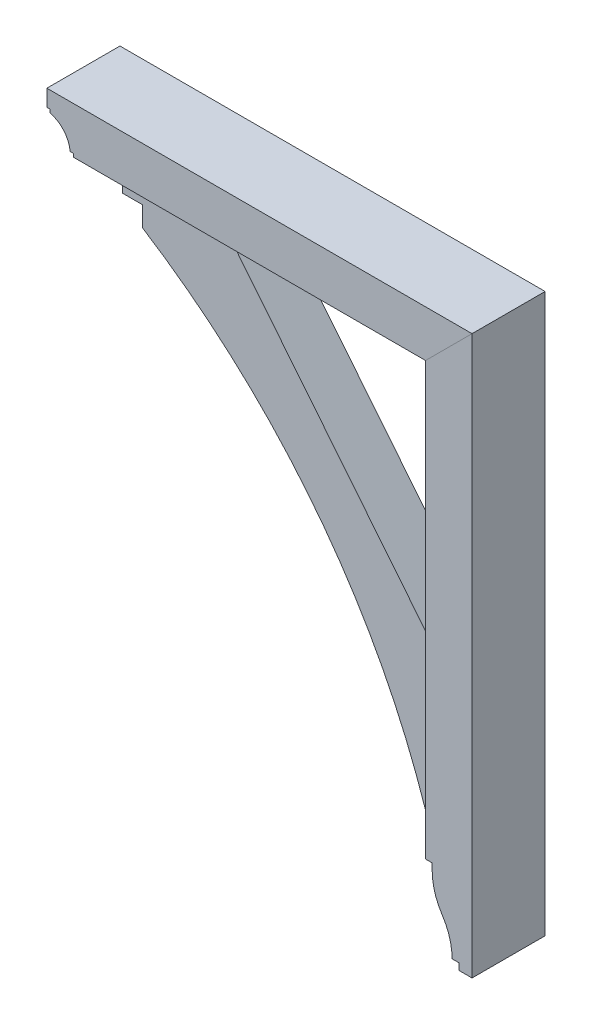
ISO-10303-21;
HEADER;
FILE_DESCRIPTION(('STEP AP214'),'2;1');
FILE_NAME('part.step','',(''),(''),'','','');
FILE_SCHEMA(('AUTOMOTIVE_DESIGN { 1 0 10303 214 1 1 1 1 }'));
ENDSEC;
DATA;
#1=APPLICATION_CONTEXT('core data for automotive mechanical design processes');
#2=APPLICATION_PROTOCOL_DEFINITION('international standard','automotive_design',2000,#1);
#3=PRODUCT_CONTEXT('',#1,'mechanical');
#4=PRODUCT('Part','Part','',(#3));
#5=PRODUCT_RELATED_PRODUCT_CATEGORY('part','',(#4));
#6=PRODUCT_DEFINITION_FORMATION('','',#4);
#7=PRODUCT_DEFINITION_CONTEXT('part definition',#1,'design');
#8=PRODUCT_DEFINITION('design','',#6,#7);
#9=PRODUCT_DEFINITION_SHAPE('','',#8);
#10=(LENGTH_UNIT() NAMED_UNIT(*) SI_UNIT(.MILLI.,.METRE.));
#11=(NAMED_UNIT(*) PLANE_ANGLE_UNIT() SI_UNIT($,.RADIAN.));
#12=(NAMED_UNIT(*) SI_UNIT($,.STERADIAN.) SOLID_ANGLE_UNIT());
#13=UNCERTAINTY_MEASURE_WITH_UNIT(LENGTH_MEASURE(1.E-05),#10,'distance_accuracy_value','');
#14=(GEOMETRIC_REPRESENTATION_CONTEXT(3) GLOBAL_UNCERTAINTY_ASSIGNED_CONTEXT((#13)) GLOBAL_UNIT_ASSIGNED_CONTEXT((#10,
#11,#12)) REPRESENTATION_CONTEXT('',''));
#15=CARTESIAN_POINT('',(0.,0.,0.));
#16=DIRECTION('',(0.,0.,1.));
#17=DIRECTION('',(1.,0.,0.));
#18=AXIS2_PLACEMENT_3D('',#15,#16,#17);
#19=CARTESIAN_POINT('',(246.881223015558,-2.15821431605898E-12,69.85));
#20=DIRECTION('',(1.,0.,0.));
#21=DIRECTION('',(0.,1.,0.));
#22=AXIS2_PLACEMENT_3D('',#19,#20,#21);
#23=PLANE('',#22);
#24=DIRECTION('',(0.,-1.,0.));
#25=VECTOR('',#24,1.);
#26=CARTESIAN_POINT('',(246.881223015558,-2.15821431605898E-12,-69.85));
#27=LINE('',#26,#25);
#28=CARTESIAN_POINT('',(246.881223015556,-183.515,-69.85));
#29=VERTEX_POINT('',#28);
#30=CARTESIAN_POINT('',(246.881223015556,-196.215,-69.85));
#31=VERTEX_POINT('',#30);
#32=EDGE_CURVE('E170',#29,#31,#27,.T.);
#33=ORIENTED_EDGE('',*,*,#32,.T.);
#34=DIRECTION('',(0.,0.,-1.));
#35=VECTOR('',#34,1.);
#36=CARTESIAN_POINT('',(246.881223015556,-196.215,69.85));
#37=LINE('',#36,#35);
#38=CARTESIAN_POINT('',(246.881223015556,-196.215,69.85));
#39=VERTEX_POINT('',#38);
#40=EDGE_CURVE('E12',#39,#31,#37,.T.);
#41=ORIENTED_EDGE('',*,*,#40,.F.);
#42=DIRECTION('',(0.,-1.,0.));
#43=VECTOR('',#42,1.);
#44=CARTESIAN_POINT('',(246.881223015558,-2.15821431605898E-12,69.85));
#45=LINE('',#44,#43);
#46=CARTESIAN_POINT('',(246.881223015556,-183.515,69.85));
#47=VERTEX_POINT('',#46);
#48=EDGE_CURVE('E203',#47,#39,#45,.T.);
#49=ORIENTED_EDGE('',*,*,#48,.F.);
#50=DIRECTION('',(0.,0.,-1.));
#51=VECTOR('',#50,1.);
#52=CARTESIAN_POINT('',(246.881223015556,-183.515,69.85));
#53=LINE('',#52,#51);
#54=EDGE_CURVE('E166',#47,#29,#53,.T.);
#55=ORIENTED_EDGE('',*,*,#54,.T.);
#56=EDGE_LOOP('',(#33,#41,#49,#55));
#57=FACE_BOUND('',#56,.T.);
#58=ADVANCED_FACE('F56',(#57),#23,.F.);
#59=CARTESIAN_POINT('',(362.768723015556,-196.215,69.85));
#60=DIRECTION('',(0.,0.,-1.));
#61=DIRECTION('',(-1.,0.,0.));
#62=AXIS2_PLACEMENT_3D('',#59,#60,#61);
#63=CYLINDRICAL_SURFACE('',#62,115.8875);
#64=CARTESIAN_POINT('',(362.768723015556,-196.215,-69.85));
#65=DIRECTION('',(0.,0.,1.));
#66=DIRECTION('',(1.,0.,0.));
#67=AXIS2_PLACEMENT_3D('',#64,#65,#66);
#68=CIRCLE('',#67,115.8875);
#69=CARTESIAN_POINT('',(266.018608336656,-260.006284403668,-69.85));
#70=VERTEX_POINT('',#69);
#71=EDGE_CURVE('E174',#31,#70,#68,.T.);
#72=ORIENTED_EDGE('',*,*,#71,.T.);
#73=DIRECTION('',(0.,0.,-1.));
#74=VECTOR('',#73,1.);
#75=CARTESIAN_POINT('',(266.018608336656,-260.006284403668,69.85));
#76=LINE('',#75,#74);
#77=CARTESIAN_POINT('',(266.018608336656,-260.006284403668,69.85));
#78=VERTEX_POINT('',#77);
#79=EDGE_CURVE('E65',#78,#70,#76,.T.);
#80=ORIENTED_EDGE('',*,*,#79,.F.);
#81=CARTESIAN_POINT('',(362.768723015556,-196.215,69.85));
#82=DIRECTION('',(0.,0.,1.));
#83=DIRECTION('',(1.,0.,0.));
#84=AXIS2_PLACEMENT_3D('',#81,#82,#83);
#85=CIRCLE('',#84,115.8875);
#86=EDGE_CURVE('E122',#39,#78,#85,.T.);
#87=ORIENTED_EDGE('',*,*,#86,.F.);
#88=ORIENTED_EDGE('',*,*,#40,.T.);
#89=EDGE_LOOP('',(#72,#80,#87,#88));
#90=FACE_BOUND('',#89,.T.);
#91=ADVANCED_FACE('F228',(#90),#63,.T.);
#92=CARTESIAN_POINT('',(170.152056348884,-323.215,69.85));
#93=DIRECTION('',(0.,0.,-1.));
#94=DIRECTION('',(-1.,0.,0.));
#95=AXIS2_PLACEMENT_3D('',#92,#93,#94);
#96=CYLINDRICAL_SURFACE('',#95,114.829166666671);
#97=CARTESIAN_POINT('',(170.152056348884,-323.215,-69.85));
#98=DIRECTION('',(0.,0.,1.));
#99=DIRECTION('',(1.,0.,0.));
#100=AXIS2_PLACEMENT_3D('',#97,#98,#99);
#101=CIRCLE('',#100,114.829166666671);
#102=CARTESIAN_POINT('',(284.981223015555,-323.215,-69.85));
#103=VERTEX_POINT('',#102);
#104=EDGE_CURVE('E178',#103,#70,#101,.T.);
#105=ORIENTED_EDGE('',*,*,#104,.F.);
#106=DIRECTION('',(0.,0.,-1.));
#107=VECTOR('',#106,1.);
#108=CARTESIAN_POINT('',(284.981223015555,-323.215,69.85));
#109=LINE('',#108,#107);
#110=CARTESIAN_POINT('',(284.981223015555,-323.215,69.85));
#111=VERTEX_POINT('',#110);
#112=EDGE_CURVE('E219',#111,#103,#109,.T.);
#113=ORIENTED_EDGE('',*,*,#112,.F.);
#114=CARTESIAN_POINT('',(170.152056348884,-323.215,69.85));
#115=DIRECTION('',(0.,0.,1.));
#116=DIRECTION('',(1.,0.,0.));
#117=AXIS2_PLACEMENT_3D('',#114,#115,#116);
#118=CIRCLE('',#117,114.829166666671);
#119=EDGE_CURVE('E227',#111,#78,#118,.T.);
#120=ORIENTED_EDGE('',*,*,#119,.T.);
#121=ORIENTED_EDGE('',*,*,#79,.T.);
#122=EDGE_LOOP('',(#105,#113,#120,#121));
#123=FACE_BOUND('',#122,.T.);
#124=ADVANCED_FACE('F225',(#123),#96,.F.);
#125=CARTESIAN_POINT('',(0.,-323.215,69.85));
#126=DIRECTION('',(0.,-1.,0.));
#127=DIRECTION('',(0.,0.,-1.));
#128=AXIS2_PLACEMENT_3D('',#125,#126,#127);
#129=PLANE('',#128);
#130=DIRECTION('',(-1.,0.,0.));
#131=VECTOR('',#130,1.);
#132=CARTESIAN_POINT('',(0.,-323.215,-69.85));
#133=LINE('',#132,#131);
#134=CARTESIAN_POINT('',(297.681223015555,-323.215,-69.85));
#135=VERTEX_POINT('',#134);
#136=EDGE_CURVE('E182',#135,#103,#133,.T.);
#137=ORIENTED_EDGE('',*,*,#136,.F.);
#138=DIRECTION('',(0.,0.,-1.));
#139=VECTOR('',#138,1.);
#140=CARTESIAN_POINT('',(297.681223015555,-323.215,69.85));
#141=LINE('',#140,#139);
#142=CARTESIAN_POINT('',(297.681223015555,-323.215,69.85));
#143=VERTEX_POINT('',#142);
#144=EDGE_CURVE('E216',#143,#135,#141,.T.);
#145=ORIENTED_EDGE('',*,*,#144,.F.);
#146=DIRECTION('',(-1.,0.,0.));
#147=VECTOR('',#146,1.);
#148=CARTESIAN_POINT('',(0.,-323.215,69.85));
#149=LINE('',#148,#147);
#150=EDGE_CURVE('E239',#143,#111,#149,.T.);
#151=ORIENTED_EDGE('',*,*,#150,.T.);
#152=ORIENTED_EDGE('',*,*,#112,.T.);
#153=EDGE_LOOP('',(#137,#145,#151,#152));
#154=FACE_BOUND('',#153,.T.);
#155=ADVANCED_FACE('F236',(#154),#129,.T.);
#156=CARTESIAN_POINT('',(297.681223015555,0.,69.85));
#157=DIRECTION('',(-1.,0.,0.));
#158=DIRECTION('',(0.,0.,1.));
#159=AXIS2_PLACEMENT_3D('',#156,#157,#158);
#160=PLANE('',#159);
#161=DIRECTION('',(0.,1.,0.));
#162=VECTOR('',#161,1.);
#163=CARTESIAN_POINT('',(297.681223015555,0.,-69.85));
#164=LINE('',#163,#162);
#165=CARTESIAN_POINT('',(297.681223015555,-335.915,-69.85));
#166=VERTEX_POINT('',#165);
#167=EDGE_CURVE('E186',#166,#135,#164,.T.);
#168=ORIENTED_EDGE('',*,*,#167,.F.);
#169=DIRECTION('',(0.,0.,-1.));
#170=VECTOR('',#169,1.);
#171=CARTESIAN_POINT('',(297.681223015555,-335.915,69.85));
#172=LINE('',#171,#170);
#173=CARTESIAN_POINT('',(297.681223015555,-335.915,69.85));
#174=VERTEX_POINT('',#173);
#175=EDGE_CURVE('E213',#174,#166,#172,.T.);
#176=ORIENTED_EDGE('',*,*,#175,.F.);
#177=DIRECTION('',(0.,1.,0.));
#178=VECTOR('',#177,1.);
#179=CARTESIAN_POINT('',(297.681223015555,0.,69.85));
#180=LINE('',#179,#178);
#181=EDGE_CURVE('E246',#174,#143,#180,.T.);
#182=ORIENTED_EDGE('',*,*,#181,.T.);
#183=ORIENTED_EDGE('',*,*,#144,.T.);
#184=EDGE_LOOP('',(#168,#176,#182,#183));
#185=FACE_BOUND('',#184,.T.);
#186=ADVANCED_FACE('F261',(#185),#160,.T.);
#187=CARTESIAN_POINT('',(7.34134975033387E-13,-335.915000000001,69.85));
#188=DIRECTION('',(0.,-1.,0.));
#189=DIRECTION('',(1.,0.,0.));
#190=AXIS2_PLACEMENT_3D('',#187,#188,#189);
#191=PLANE('',#190);
#192=DIRECTION('',(-1.,0.,0.));
#193=VECTOR('',#192,1.);
#194=CARTESIAN_POINT('',(7.34134975033387E-13,-335.915000000001,-69.85));
#195=LINE('',#194,#193);
#196=CARTESIAN_POINT('',(323.081223015555,-335.915,-69.85));
#197=VERTEX_POINT('',#196);
#198=EDGE_CURVE('E190',#197,#166,#195,.T.);
#199=ORIENTED_EDGE('',*,*,#198,.F.);
#200=DIRECTION('',(0.,0.,-1.));
#201=VECTOR('',#200,1.);
#202=CARTESIAN_POINT('',(323.081223015555,-335.915,69.85));
#203=LINE('',#202,#201);
#204=CARTESIAN_POINT('',(323.081223015555,-335.915,69.85));
#205=VERTEX_POINT('',#204);
#206=EDGE_CURVE('E210',#205,#197,#203,.T.);
#207=ORIENTED_EDGE('',*,*,#206,.F.);
#208=DIRECTION('',(-1.,0.,0.));
#209=VECTOR('',#208,1.);
#210=CARTESIAN_POINT('',(7.34134975033387E-13,-335.915000000001,69.85));
#211=LINE('',#210,#209);
#212=EDGE_CURVE('E253',#205,#174,#211,.T.);
#213=ORIENTED_EDGE('',*,*,#212,.T.);
#214=ORIENTED_EDGE('',*,*,#175,.T.);
#215=EDGE_LOOP('',(#199,#207,#213,#214));
#216=FACE_BOUND('',#215,.T.);
#217=ADVANCED_FACE('F259',(#216),#191,.T.);
#218=CARTESIAN_POINT('',(323.081223015555,0.,69.85));
#219=DIRECTION('',(-1.,0.,0.));
#220=DIRECTION('',(0.,0.,1.));
#221=AXIS2_PLACEMENT_3D('',#218,#219,#220);
#222=PLANE('',#221);
#223=DIRECTION('',(0.,1.,0.));
#224=VECTOR('',#223,1.);
#225=CARTESIAN_POINT('',(323.081223015555,0.,-69.85));
#226=LINE('',#225,#224);
#227=CARTESIAN_POINT('',(323.081223015555,730.885,-69.85));
#228=VERTEX_POINT('',#227);
#229=EDGE_CURVE('E194',#197,#228,#226,.T.);
#230=ORIENTED_EDGE('',*,*,#229,.T.);
#231=DIRECTION('',(0.,0.,-1.));
#232=VECTOR('',#231,1.);
#233=CARTESIAN_POINT('',(323.081223015555,730.885,69.85));
#234=LINE('',#233,#232);
#235=CARTESIAN_POINT('',(323.081223015555,730.885,69.85));
#236=VERTEX_POINT('',#235);
#237=EDGE_CURVE('E159',#236,#228,#234,.T.);
#238=ORIENTED_EDGE('',*,*,#237,.F.);
#239=DIRECTION('',(0.,1.,0.));
#240=VECTOR('',#239,1.);
#241=CARTESIAN_POINT('',(323.081223015555,0.,69.85));
#242=LINE('',#241,#240);
#243=EDGE_CURVE('E148',#205,#236,#242,.T.);
#244=ORIENTED_EDGE('',*,*,#243,.F.);
#245=ORIENTED_EDGE('',*,*,#206,.T.);
#246=EDGE_LOOP('',(#230,#238,#244,#245));
#247=FACE_BOUND('',#246,.T.);
#248=ADVANCED_FACE('F264',(#247),#222,.F.);
#249=CARTESIAN_POINT('',(-203.901888492221,203.901888492218,69.85));
#250=DIRECTION('',(0.707106781186552,-0.707106781186543,0.));
#251=DIRECTION('',(0.707106781186543,0.707106781186552,0.));
#252=AXIS2_PLACEMENT_3D('',#249,#250,#251);
#253=PLANE('',#252);
#254=DIRECTION('',(-0.707106781186543,-0.707106781186552,0.));
#255=VECTOR('',#254,1.);
#256=CARTESIAN_POINT('',(-203.901888492221,203.901888492218,-69.85));
#257=LINE('',#256,#255);
#258=CARTESIAN_POINT('',(234.181223015556,641.985,-69.85));
#259=VERTEX_POINT('',#258);
#260=EDGE_CURVE('E157',#228,#259,#257,.T.);
#261=ORIENTED_EDGE('',*,*,#260,.T.);
#262=DIRECTION('',(0.,0.,-1.));
#263=VECTOR('',#262,1.);
#264=CARTESIAN_POINT('',(234.181223015556,641.985,69.85));
#265=LINE('',#264,#263);
#266=CARTESIAN_POINT('',(234.181223015556,641.985,69.85));
#267=VERTEX_POINT('',#266);
#268=EDGE_CURVE('E154',#267,#259,#265,.T.);
#269=ORIENTED_EDGE('',*,*,#268,.F.);
#270=DIRECTION('',(-0.707106781186543,-0.707106781186552,0.));
#271=VECTOR('',#270,1.);
#272=CARTESIAN_POINT('',(-203.901888492221,203.901888492218,69.85));
#273=LINE('',#272,#271);
#274=EDGE_CURVE('E141',#236,#267,#273,.T.);
#275=ORIENTED_EDGE('',*,*,#274,.F.);
#276=ORIENTED_EDGE('',*,*,#237,.T.);
#277=EDGE_LOOP('',(#261,#269,#275,#276));
#278=FACE_BOUND('',#277,.T.);
#279=ADVANCED_FACE('F155',(#278),#253,.F.);
#280=CARTESIAN_POINT('',(234.181223015556,0.,69.85));
#281=DIRECTION('',(1.,0.,0.));
#282=DIRECTION('',(0.,1.,0.));
#283=AXIS2_PLACEMENT_3D('',#280,#281,#282);
#284=PLANE('',#283);
#285=DIRECTION('',(0.,-1.,0.));
#286=VECTOR('',#285,1.);
#287=CARTESIAN_POINT('',(234.181223015556,0.,-69.85));
#288=LINE('',#287,#286);
#289=CARTESIAN_POINT('',(234.181223015556,-183.515,-69.85));
#290=VERTEX_POINT('',#289);
#291=EDGE_CURVE('E108',#259,#290,#288,.T.);
#292=ORIENTED_EDGE('',*,*,#291,.T.);
#293=DIRECTION('',(0.,0.,-1.));
#294=VECTOR('',#293,1.);
#295=CARTESIAN_POINT('',(234.181223015556,-183.515,69.85));
#296=LINE('',#295,#294);
#297=CARTESIAN_POINT('',(234.181223015556,-183.515,69.85));
#298=VERTEX_POINT('',#297);
#299=EDGE_CURVE('E160',#298,#290,#296,.T.);
#300=ORIENTED_EDGE('',*,*,#299,.F.);
#301=DIRECTION('',(0.,-1.,0.));
#302=VECTOR('',#301,1.);
#303=CARTESIAN_POINT('',(234.181223015556,0.,69.85));
#304=LINE('',#303,#302);
#305=EDGE_CURVE('E145',#267,#298,#304,.T.);
#306=ORIENTED_EDGE('',*,*,#305,.F.);
#307=ORIENTED_EDGE('',*,*,#268,.T.);
#308=EDGE_LOOP('',(#292,#300,#306,#307));
#309=FACE_BOUND('',#308,.T.);
#310=ADVANCED_FACE('F162',(#309),#284,.F.);
#311=CARTESIAN_POINT('',(0.,-183.515,69.85));
#312=DIRECTION('',(0.,1.,0.));
#313=DIRECTION('',(0.,0.,1.));
#314=AXIS2_PLACEMENT_3D('',#311,#312,#313);
#315=PLANE('',#314);
#316=DIRECTION('',(1.,0.,0.));
#317=VECTOR('',#316,1.);
#318=CARTESIAN_POINT('',(0.,-183.515,-69.85));
#319=LINE('',#318,#317);
#320=EDGE_CURVE('E114',#290,#29,#319,.T.);
#321=ORIENTED_EDGE('',*,*,#320,.T.);
#322=ORIENTED_EDGE('',*,*,#54,.F.);
#323=DIRECTION('',(1.,0.,0.));
#324=VECTOR('',#323,1.);
#325=CARTESIAN_POINT('',(0.,-183.515,69.85));
#326=LINE('',#325,#324);
#327=EDGE_CURVE('E73',#298,#47,#326,.T.);
#328=ORIENTED_EDGE('',*,*,#327,.F.);
#329=ORIENTED_EDGE('',*,*,#299,.T.);
#330=EDGE_LOOP('',(#321,#322,#328,#329));
#331=FACE_BOUND('',#330,.T.);
#332=ADVANCED_FACE('F279',(#331),#315,.F.);
#333=CARTESIAN_POINT('',(0.,0.,69.85));
#334=DIRECTION('',(0.,0.,1.));
#335=DIRECTION('',(1.,0.,0.));
#336=AXIS2_PLACEMENT_3D('',#333,#334,#335);
#337=PLANE('',#336);
#338=ORIENTED_EDGE('',*,*,#48,.T.);
#339=ORIENTED_EDGE('',*,*,#86,.T.);
#340=ORIENTED_EDGE('',*,*,#119,.F.);
#341=ORIENTED_EDGE('',*,*,#150,.F.);
#342=ORIENTED_EDGE('',*,*,#181,.F.);
#343=ORIENTED_EDGE('',*,*,#212,.F.);
#344=ORIENTED_EDGE('',*,*,#243,.T.);
#345=ORIENTED_EDGE('',*,*,#274,.T.);
#346=ORIENTED_EDGE('',*,*,#305,.T.);
#347=ORIENTED_EDGE('',*,*,#327,.T.);
#348=EDGE_LOOP('',(#338,#339,#340,#341,#342,#343,#344,#345,#346,#347));
#349=FACE_BOUND('',#348,.T.);
#350=ADVANCED_FACE('F143',(#349),#337,.T.);
#351=CARTESIAN_POINT('',(0.,0.,-69.85));
#352=DIRECTION('',(0.,0.,1.));
#353=DIRECTION('',(1.,0.,0.));
#354=AXIS2_PLACEMENT_3D('',#351,#352,#353);
#355=PLANE('',#354);
#356=ORIENTED_EDGE('',*,*,#32,.F.);
#357=ORIENTED_EDGE('',*,*,#320,.F.);
#358=ORIENTED_EDGE('',*,*,#291,.F.);
#359=ORIENTED_EDGE('',*,*,#260,.F.);
#360=ORIENTED_EDGE('',*,*,#229,.F.);
#361=ORIENTED_EDGE('',*,*,#198,.T.);
#362=ORIENTED_EDGE('',*,*,#167,.T.);
#363=ORIENTED_EDGE('',*,*,#136,.T.);
#364=ORIENTED_EDGE('',*,*,#104,.T.);
#365=ORIENTED_EDGE('',*,*,#71,.F.);
#366=EDGE_LOOP('',(#356,#357,#358,#359,#360,#361,#362,#363,#364,#365));
#367=FACE_BOUND('',#366,.T.);
#368=ADVANCED_FACE('F232',(#367),#355,.F.);
#369=CLOSED_SHELL('',(#58,#91,#124,#155,#186,#217,#248,#279,#310,#332,#350,#368));
#370=MANIFOLD_SOLID_BREP('B2',#369);
#371=CARTESIAN_POINT('',(-332.556276984445,0.,44.45));
#372=DIRECTION('',(1.,0.,0.));
#373=DIRECTION('',(0.,0.,-1.));
#374=AXIS2_PLACEMENT_3D('',#371,#372,#373);
#375=PLANE('',#374);
#376=DIRECTION('',(0.,-1.,0.));
#377=VECTOR('',#376,1.);
#378=CARTESIAN_POINT('',(-332.556276984445,0.,-44.45));
#379=LINE('',#378,#377);
#380=CARTESIAN_POINT('',(-332.556276984445,603.885,-44.45));
#381=VERTEX_POINT('',#380);
#382=CARTESIAN_POINT('',(-332.556276984445,565.785,-44.45));
#383=VERTEX_POINT('',#382);
#384=EDGE_CURVE('E485',#381,#383,#379,.T.);
#385=ORIENTED_EDGE('',*,*,#384,.T.);
#386=DIRECTION('',(0.,0.,-1.));
#387=VECTOR('',#386,1.);
#388=CARTESIAN_POINT('',(-332.556276984445,565.785,44.45));
#389=LINE('',#388,#387);
#390=CARTESIAN_POINT('',(-332.556276984445,565.785,44.45));
#391=VERTEX_POINT('',#390);
#392=EDGE_CURVE('E54',#391,#383,#389,.T.);
#393=ORIENTED_EDGE('',*,*,#392,.F.);
#394=DIRECTION('',(0.,-1.,0.));
#395=VECTOR('',#394,1.);
#396=CARTESIAN_POINT('',(-332.556276984445,0.,44.45));
#397=LINE('',#396,#395);
#398=CARTESIAN_POINT('',(-332.556276984445,603.885,44.45));
#399=VERTEX_POINT('',#398);
#400=EDGE_CURVE('E503',#399,#391,#397,.T.);
#401=ORIENTED_EDGE('',*,*,#400,.F.);
#402=DIRECTION('',(0.,0.,-1.));
#403=VECTOR('',#402,1.);
#404=CARTESIAN_POINT('',(-332.556276984445,603.885,44.45));
#405=LINE('',#404,#403);
#406=EDGE_CURVE('E484',#399,#381,#405,.T.);
#407=ORIENTED_EDGE('',*,*,#406,.T.);
#408=EDGE_LOOP('',(#385,#393,#401,#407));
#409=FACE_BOUND('',#408,.T.);
#410=ADVANCED_FACE('F387',(#409),#375,.F.);
#411=CARTESIAN_POINT('',(-1033.08252911568,-538.92698964932,44.45));
#412=DIRECTION('',(0.,0.,-1.));
#413=DIRECTION('',(-1.,0.,0.));
#414=AXIS2_PLACEMENT_3D('',#411,#412,#413);
#415=CYLINDRICAL_SURFACE('',#414,1308.1);
#416=CARTESIAN_POINT('',(-1033.08252911568,-538.92698964932,-44.45));
#417=DIRECTION('',(0.,0.,1.));
#418=DIRECTION('',(1.,0.,0.));
#419=AXIS2_PLACEMENT_3D('',#416,#417,#418);
#420=CIRCLE('',#419,1308.1);
#421=CARTESIAN_POINT('',(208.781223015556,-127.9525,-44.45));
#422=VERTEX_POINT('',#421);
#423=EDGE_CURVE('E488',#383,#422,#420,.F.);
#424=ORIENTED_EDGE('',*,*,#423,.T.);
#425=DIRECTION('',(0.,0.,-1.));
#426=VECTOR('',#425,1.);
#427=CARTESIAN_POINT('',(208.781223015556,-127.9525,44.45));
#428=LINE('',#427,#426);
#429=CARTESIAN_POINT('',(208.781223015556,-127.9525,44.45));
#430=VERTEX_POINT('',#429);
#431=EDGE_CURVE('E395',#430,#422,#428,.T.);
#432=ORIENTED_EDGE('',*,*,#431,.F.);
#433=CARTESIAN_POINT('',(-1033.08252911568,-538.92698964932,44.45));
#434=DIRECTION('',(0.,0.,1.));
#435=DIRECTION('',(1.,0.,0.));
#436=AXIS2_PLACEMENT_3D('',#433,#434,#435);
#437=CIRCLE('',#436,1308.1);
#438=EDGE_CURVE('E445',#391,#430,#437,.F.);
#439=ORIENTED_EDGE('',*,*,#438,.F.);
#440=ORIENTED_EDGE('',*,*,#392,.T.);
#441=EDGE_LOOP('',(#424,#432,#439,#440));
#442=FACE_BOUND('',#441,.T.);
#443=ADVANCED_FACE('F516',(#442),#415,.F.);
#444=CARTESIAN_POINT('',(0.,-127.9525,44.45));
#445=DIRECTION('',(0.,-1.,0.));
#446=DIRECTION('',(0.,0.,-1.));
#447=AXIS2_PLACEMENT_3D('',#444,#445,#446);
#448=PLANE('',#447);
#449=DIRECTION('',(-1.,0.,0.));
#450=VECTOR('',#449,1.);
#451=CARTESIAN_POINT('',(0.,-127.9525,-44.45));
#452=LINE('',#451,#450);
#453=CARTESIAN_POINT('',(234.181223015556,-127.9525,-44.45));
#454=VERTEX_POINT('',#453);
#455=EDGE_CURVE('E491',#454,#422,#452,.T.);
#456=ORIENTED_EDGE('',*,*,#455,.F.);
#457=DIRECTION('',(0.,0.,-1.));
#458=VECTOR('',#457,1.);
#459=CARTESIAN_POINT('',(234.181223015556,-127.9525,44.45));
#460=LINE('',#459,#458);
#461=CARTESIAN_POINT('',(234.181223015556,-127.9525,44.45));
#462=VERTEX_POINT('',#461);
#463=EDGE_CURVE('E509',#462,#454,#460,.T.);
#464=ORIENTED_EDGE('',*,*,#463,.F.);
#465=DIRECTION('',(-1.,0.,0.));
#466=VECTOR('',#465,1.);
#467=CARTESIAN_POINT('',(0.,-127.9525,44.45));
#468=LINE('',#467,#466);
#469=EDGE_CURVE('E515',#462,#430,#468,.T.);
#470=ORIENTED_EDGE('',*,*,#469,.T.);
#471=ORIENTED_EDGE('',*,*,#431,.T.);
#472=EDGE_LOOP('',(#456,#464,#470,#471));
#473=FACE_BOUND('',#472,.T.);
#474=ADVANCED_FACE('F513',(#473),#448,.T.);
#475=CARTESIAN_POINT('',(234.181223015556,0.,44.45));
#476=DIRECTION('',(1.,0.,0.));
#477=DIRECTION('',(0.,1.,0.));
#478=AXIS2_PLACEMENT_3D('',#475,#476,#477);
#479=PLANE('',#478);
#480=DIRECTION('',(0.,-1.,0.));
#481=VECTOR('',#480,1.);
#482=CARTESIAN_POINT('',(234.181223015556,0.,-44.45));
#483=LINE('',#482,#481);
#484=CARTESIAN_POINT('',(234.181223015556,137.16,-44.45));
#485=VERTEX_POINT('',#484);
#486=EDGE_CURVE('E494',#485,#454,#483,.T.);
#487=ORIENTED_EDGE('',*,*,#486,.F.);
#488=DIRECTION('',(0.,0.,-1.));
#489=VECTOR('',#488,1.);
#490=CARTESIAN_POINT('',(234.181223015556,137.16,44.45));
#491=LINE('',#490,#489);
#492=CARTESIAN_POINT('',(234.181223015556,137.16,44.45));
#493=VERTEX_POINT('',#492);
#494=EDGE_CURVE('E507',#493,#485,#491,.T.);
#495=ORIENTED_EDGE('',*,*,#494,.F.);
#496=DIRECTION('',(0.,-1.,0.));
#497=VECTOR('',#496,1.);
#498=CARTESIAN_POINT('',(234.181223015556,0.,44.45));
#499=LINE('',#498,#497);
#500=EDGE_CURVE('E479',#493,#462,#499,.T.);
#501=ORIENTED_EDGE('',*,*,#500,.T.);
#502=ORIENTED_EDGE('',*,*,#463,.T.);
#503=EDGE_LOOP('',(#487,#495,#501,#502));
#504=FACE_BOUND('',#503,.T.);
#505=ADVANCED_FACE('F524',(#504),#479,.T.);
#506=CARTESIAN_POINT('',(209.091943335084,168.325589603086,44.45));
#507=DIRECTION('',(0.778953317427193,0.627081915916231,0.));
#508=DIRECTION('',(-0.627081915916231,0.778953317427193,0.));
#509=AXIS2_PLACEMENT_3D('',#506,#507,#508);
#510=PLANE('',#509);
#511=DIRECTION('',(0.627081915916231,-0.778953317427193,0.));
#512=VECTOR('',#511,1.);
#513=CARTESIAN_POINT('',(209.091943335084,168.325589603086,-44.45));
#514=LINE('',#513,#512);
#515=CARTESIAN_POINT('',(-172.218776984444,641.985,-44.45));
#516=VERTEX_POINT('',#515);
#517=EDGE_CURVE('E497',#516,#485,#514,.T.);
#518=ORIENTED_EDGE('',*,*,#517,.F.);
#519=DIRECTION('',(0.,0.,-1.));
#520=VECTOR('',#519,1.);
#521=CARTESIAN_POINT('',(-172.218776984444,641.985,44.45));
#522=LINE('',#521,#520);
#523=CARTESIAN_POINT('',(-172.218776984444,641.985,44.45));
#524=VERTEX_POINT('',#523);
#525=EDGE_CURVE('E467',#524,#516,#522,.T.);
#526=ORIENTED_EDGE('',*,*,#525,.F.);
#527=DIRECTION('',(0.627081915916231,-0.778953317427193,0.));
#528=VECTOR('',#527,1.);
#529=CARTESIAN_POINT('',(209.091943335084,168.325589603086,44.45));
#530=LINE('',#529,#528);
#531=EDGE_CURVE('E477',#524,#493,#530,.T.);
#532=ORIENTED_EDGE('',*,*,#531,.T.);
#533=ORIENTED_EDGE('',*,*,#494,.T.);
#534=EDGE_LOOP('',(#518,#526,#532,#533));
#535=FACE_BOUND('',#534,.T.);
#536=ADVANCED_FACE('F552',(#535),#510,.T.);
#537=CARTESIAN_POINT('',(0.,641.985,44.45));
#538=DIRECTION('',(0.,1.,0.));
#539=DIRECTION('',(0.,0.,1.));
#540=AXIS2_PLACEMENT_3D('',#537,#538,#539);
#541=PLANE('',#540);
#542=DIRECTION('',(1.,0.,0.));
#543=VECTOR('',#542,1.);
#544=CARTESIAN_POINT('',(0.,641.985,-44.45));
#545=LINE('',#544,#543);
#546=CARTESIAN_POINT('',(-370.656276984445,641.985,-44.45));
#547=VERTEX_POINT('',#546);
#548=EDGE_CURVE('E466',#547,#516,#545,.T.);
#549=ORIENTED_EDGE('',*,*,#548,.F.);
#550=DIRECTION('',(0.,0.,-1.));
#551=VECTOR('',#550,1.);
#552=CARTESIAN_POINT('',(-370.656276984445,641.985,44.45));
#553=LINE('',#552,#551);
#554=CARTESIAN_POINT('',(-370.656276984445,641.985,44.45));
#555=VERTEX_POINT('',#554);
#556=EDGE_CURVE('E460',#555,#547,#553,.T.);
#557=ORIENTED_EDGE('',*,*,#556,.F.);
#558=DIRECTION('',(1.,0.,0.));
#559=VECTOR('',#558,1.);
#560=CARTESIAN_POINT('',(0.,641.985,44.45));
#561=LINE('',#560,#559);
#562=EDGE_CURVE('E464',#555,#524,#561,.T.);
#563=ORIENTED_EDGE('',*,*,#562,.T.);
#564=ORIENTED_EDGE('',*,*,#525,.T.);
#565=EDGE_LOOP('',(#549,#557,#563,#564));
#566=FACE_BOUND('',#565,.T.);
#567=ADVANCED_FACE('F462',(#566),#541,.T.);
#568=CARTESIAN_POINT('',(-370.656276984444,-5.40040856863477E-13,44.45));
#569=DIRECTION('',(1.,0.,0.));
#570=DIRECTION('',(0.,1.,0.));
#571=AXIS2_PLACEMENT_3D('',#568,#569,#570);
#572=PLANE('',#571);
#573=DIRECTION('',(0.,-1.,0.));
#574=VECTOR('',#573,1.);
#575=CARTESIAN_POINT('',(-370.656276984444,-5.40040856863477E-13,-44.45));
#576=LINE('',#575,#574);
#577=CARTESIAN_POINT('',(-370.656276984445,603.885,-44.45));
#578=VERTEX_POINT('',#577);
#579=EDGE_CURVE('E431',#547,#578,#576,.T.);
#580=ORIENTED_EDGE('',*,*,#579,.T.);
#581=DIRECTION('',(0.,0.,-1.));
#582=VECTOR('',#581,1.);
#583=CARTESIAN_POINT('',(-370.656276984445,603.885,44.45));
#584=LINE('',#583,#582);
#585=CARTESIAN_POINT('',(-370.656276984445,603.885,44.45));
#586=VERTEX_POINT('',#585);
#587=EDGE_CURVE('E468',#586,#578,#584,.T.);
#588=ORIENTED_EDGE('',*,*,#587,.F.);
#589=DIRECTION('',(0.,-1.,0.));
#590=VECTOR('',#589,1.);
#591=CARTESIAN_POINT('',(-370.656276984444,-5.40040856863477E-13,44.45));
#592=LINE('',#591,#590);
#593=EDGE_CURVE('E470',#555,#586,#592,.T.);
#594=ORIENTED_EDGE('',*,*,#593,.F.);
#595=ORIENTED_EDGE('',*,*,#556,.T.);
#596=EDGE_LOOP('',(#580,#588,#594,#595));
#597=FACE_BOUND('',#596,.T.);
#598=ADVANCED_FACE('F471',(#597),#572,.F.);
#599=CARTESIAN_POINT('',(0.,603.885,44.45));
#600=DIRECTION('',(0.,1.,0.));
#601=DIRECTION('',(0.,0.,1.));
#602=AXIS2_PLACEMENT_3D('',#599,#600,#601);
#603=PLANE('',#602);
#604=DIRECTION('',(1.,0.,0.));
#605=VECTOR('',#604,1.);
#606=CARTESIAN_POINT('',(0.,603.885,-44.45));
#607=LINE('',#606,#605);
#608=EDGE_CURVE('E437',#578,#381,#607,.T.);
#609=ORIENTED_EDGE('',*,*,#608,.T.);
#610=ORIENTED_EDGE('',*,*,#406,.F.);
#611=DIRECTION('',(1.,0.,0.));
#612=VECTOR('',#611,1.);
#613=CARTESIAN_POINT('',(0.,603.885,44.45));
#614=LINE('',#613,#612);
#615=EDGE_CURVE('E403',#586,#399,#614,.T.);
#616=ORIENTED_EDGE('',*,*,#615,.F.);
#617=ORIENTED_EDGE('',*,*,#587,.T.);
#618=EDGE_LOOP('',(#609,#610,#616,#617));
#619=FACE_BOUND('',#618,.T.);
#620=ADVANCED_FACE('F531',(#619),#603,.F.);
#621=CARTESIAN_POINT('',(0.,0.,44.45));
#622=DIRECTION('',(0.,0.,1.));
#623=DIRECTION('',(1.,0.,0.));
#624=AXIS2_PLACEMENT_3D('',#621,#622,#623);
#625=PLANE('',#624);
#626=ORIENTED_EDGE('',*,*,#400,.T.);
#627=ORIENTED_EDGE('',*,*,#438,.T.);
#628=ORIENTED_EDGE('',*,*,#469,.F.);
#629=ORIENTED_EDGE('',*,*,#500,.F.);
#630=ORIENTED_EDGE('',*,*,#531,.F.);
#631=ORIENTED_EDGE('',*,*,#562,.F.);
#632=ORIENTED_EDGE('',*,*,#593,.T.);
#633=ORIENTED_EDGE('',*,*,#615,.T.);
#634=EDGE_LOOP('',(#626,#627,#628,#629,#630,#631,#632,#633));
#635=FACE_BOUND('',#634,.T.);
#636=ADVANCED_FACE('F474',(#635),#625,.T.);
#637=CARTESIAN_POINT('',(0.,0.,-44.45));
#638=DIRECTION('',(0.,0.,1.));
#639=DIRECTION('',(1.,0.,0.));
#640=AXIS2_PLACEMENT_3D('',#637,#638,#639);
#641=PLANE('',#640);
#642=ORIENTED_EDGE('',*,*,#384,.F.);
#643=ORIENTED_EDGE('',*,*,#608,.F.);
#644=ORIENTED_EDGE('',*,*,#579,.F.);
#645=ORIENTED_EDGE('',*,*,#548,.T.);
#646=ORIENTED_EDGE('',*,*,#517,.T.);
#647=ORIENTED_EDGE('',*,*,#486,.T.);
#648=ORIENTED_EDGE('',*,*,#455,.T.);
#649=ORIENTED_EDGE('',*,*,#423,.F.);
#650=EDGE_LOOP('',(#642,#643,#644,#645,#646,#647,#648,#649));
#651=FACE_BOUND('',#650,.T.);
#652=ADVANCED_FACE('F520',(#651),#641,.F.);
#653=CLOSED_SHELL('',(#410,#443,#474,#505,#536,#567,#598,#620,#636,#652));
#654=MANIFOLD_SOLID_BREP('B6',#653);
#655=CARTESIAN_POINT('',(-483.368776984451,4.22556807553577E-12,69.85));
#656=DIRECTION('',(-1.,0.,0.));
#657=DIRECTION('',(0.,-1.,0.));
#658=AXIS2_PLACEMENT_3D('',#655,#656,#657);
#659=PLANE('',#658);
#660=DIRECTION('',(0.,1.,0.));
#661=VECTOR('',#660,1.);
#662=CARTESIAN_POINT('',(-483.368776984451,4.22556807553577E-12,-69.85));
#663=LINE('',#662,#661);
#664=CARTESIAN_POINT('',(-483.368776984445,692.785,-69.85));
#665=VERTEX_POINT('',#664);
#666=CARTESIAN_POINT('',(-483.368776984445,699.135,-69.85));
#667=VERTEX_POINT('',#666);
#668=EDGE_CURVE('E724',#665,#667,#663,.T.);
#669=ORIENTED_EDGE('',*,*,#668,.F.);
#670=DIRECTION('',(0.,0.,-1.));
#671=VECTOR('',#670,1.);
#672=CARTESIAN_POINT('',(-483.368776984445,692.785,69.85));
#673=LINE('',#672,#671);
#674=CARTESIAN_POINT('',(-483.368776984445,692.785,69.85));
#675=VERTEX_POINT('',#674);
#676=EDGE_CURVE('E385',#675,#665,#673,.T.);
#677=ORIENTED_EDGE('',*,*,#676,.F.);
#678=DIRECTION('',(0.,1.,0.));
#679=VECTOR('',#678,1.);
#680=CARTESIAN_POINT('',(-483.368776984451,4.22556807553577E-12,69.85));
#681=LINE('',#680,#679);
#682=CARTESIAN_POINT('',(-483.368776984445,699.135,69.85));
#683=VERTEX_POINT('',#682);
#684=EDGE_CURVE('E747',#675,#683,#681,.T.);
#685=ORIENTED_EDGE('',*,*,#684,.T.);
#686=DIRECTION('',(0.,0.,-1.));
#687=VECTOR('',#686,1.);
#688=CARTESIAN_POINT('',(-483.368776984445,699.135,69.85));
#689=LINE('',#688,#687);
#690=EDGE_CURVE('E641',#683,#667,#689,.T.);
#691=ORIENTED_EDGE('',*,*,#690,.T.);
#692=EDGE_LOOP('',(#669,#677,#685,#691));
#693=FACE_BOUND('',#692,.T.);
#694=ADVANCED_FACE('F625',(#693),#659,.T.);
#695=CARTESIAN_POINT('',(-495.780101736884,643.593150212196,69.85));
#696=DIRECTION('',(0.,0.,-1.));
#697=DIRECTION('',(-1.,0.,0.));
#698=AXIS2_PLACEMENT_3D('',#695,#696,#697);
#699=CYLINDRICAL_SURFACE('',#698,50.7334117486339);
#700=CARTESIAN_POINT('',(-495.780101736884,643.593150212196,-69.85));
#701=DIRECTION('',(0.,0.,1.));
#702=DIRECTION('',(1.,0.,0.));
#703=AXIS2_PLACEMENT_3D('',#700,#701,#702);
#704=CIRCLE('',#703,50.7334117486339);
#705=CARTESIAN_POINT('',(-445.268776984445,648.335,-69.85));
#706=VERTEX_POINT('',#705);
#707=EDGE_CURVE('E726',#665,#706,#704,.F.);
#708=ORIENTED_EDGE('',*,*,#707,.T.);
#709=DIRECTION('',(0.,0.,-1.));
#710=VECTOR('',#709,1.);
#711=CARTESIAN_POINT('',(-445.268776984445,648.335,69.85));
#712=LINE('',#711,#710);
#713=CARTESIAN_POINT('',(-445.268776984445,648.335,69.85));
#714=VERTEX_POINT('',#713);
#715=EDGE_CURVE('E633',#714,#706,#712,.T.);
#716=ORIENTED_EDGE('',*,*,#715,.F.);
#717=CARTESIAN_POINT('',(-495.780101736884,643.593150212196,69.85));
#718=DIRECTION('',(0.,0.,1.));
#719=DIRECTION('',(1.,0.,0.));
#720=AXIS2_PLACEMENT_3D('',#717,#718,#719);
#721=CIRCLE('',#720,50.7334117486339);
#722=EDGE_CURVE('E776',#675,#714,#721,.F.);
#723=ORIENTED_EDGE('',*,*,#722,.F.);
#724=ORIENTED_EDGE('',*,*,#676,.T.);
#725=EDGE_LOOP('',(#708,#716,#723,#724));
#726=FACE_BOUND('',#725,.T.);
#727=ADVANCED_FACE('F765',(#726),#699,.F.);
#728=CARTESIAN_POINT('',(0.,648.335,69.85));
#729=DIRECTION('',(0.,-1.,0.));
#730=DIRECTION('',(0.,0.,-1.));
#731=AXIS2_PLACEMENT_3D('',#728,#729,#730);
#732=PLANE('',#731);
#733=DIRECTION('',(-1.,0.,0.));
#734=VECTOR('',#733,1.);
#735=CARTESIAN_POINT('',(0.,648.335,-69.85));
#736=LINE('',#735,#734);
#737=CARTESIAN_POINT('',(-438.918776984445,648.335,-69.85));
#738=VERTEX_POINT('',#737);
#739=EDGE_CURVE('E729',#738,#706,#736,.T.);
#740=ORIENTED_EDGE('',*,*,#739,.F.);
#741=DIRECTION('',(0.,0.,-1.));
#742=VECTOR('',#741,1.);
#743=CARTESIAN_POINT('',(-438.918776984445,648.335,69.85));
#744=LINE('',#743,#742);
#745=CARTESIAN_POINT('',(-438.918776984445,648.335,69.85));
#746=VERTEX_POINT('',#745);
#747=EDGE_CURVE('E755',#746,#738,#744,.T.);
#748=ORIENTED_EDGE('',*,*,#747,.F.);
#749=DIRECTION('',(-1.,0.,0.));
#750=VECTOR('',#749,1.);
#751=CARTESIAN_POINT('',(0.,648.335,69.85));
#752=LINE('',#751,#750);
#753=EDGE_CURVE('E762',#746,#714,#752,.T.);
#754=ORIENTED_EDGE('',*,*,#753,.T.);
#755=ORIENTED_EDGE('',*,*,#715,.T.);
#756=EDGE_LOOP('',(#740,#748,#754,#755));
#757=FACE_BOUND('',#756,.T.);
#758=ADVANCED_FACE('F760',(#757),#732,.T.);
#759=CARTESIAN_POINT('',(-438.918776984445,0.,69.85));
#760=DIRECTION('',(-1.,0.,0.));
#761=DIRECTION('',(0.,0.,1.));
#762=AXIS2_PLACEMENT_3D('',#759,#760,#761);
#763=PLANE('',#762);
#764=DIRECTION('',(0.,1.,0.));
#765=VECTOR('',#764,1.);
#766=CARTESIAN_POINT('',(-438.918776984445,0.,-69.85));
#767=LINE('',#766,#765);
#768=CARTESIAN_POINT('',(-438.918776984445,641.985,-69.85));
#769=VERTEX_POINT('',#768);
#770=EDGE_CURVE('E732',#769,#738,#767,.T.);
#771=ORIENTED_EDGE('',*,*,#770,.F.);
#772=DIRECTION('',(0.,0.,-1.));
#773=VECTOR('',#772,1.);
#774=CARTESIAN_POINT('',(-438.918776984445,641.985,69.85));
#775=LINE('',#774,#773);
#776=CARTESIAN_POINT('',(-438.918776984445,641.985,69.85));
#777=VERTEX_POINT('',#776);
#778=EDGE_CURVE('E753',#777,#769,#775,.T.);
#779=ORIENTED_EDGE('',*,*,#778,.F.);
#780=DIRECTION('',(0.,1.,0.));
#781=VECTOR('',#780,1.);
#782=CARTESIAN_POINT('',(-438.918776984445,0.,69.85));
#783=LINE('',#782,#781);
#784=EDGE_CURVE('E775',#777,#746,#783,.T.);
#785=ORIENTED_EDGE('',*,*,#784,.T.);
#786=ORIENTED_EDGE('',*,*,#747,.T.);
#787=EDGE_LOOP('',(#771,#779,#785,#786));
#788=FACE_BOUND('',#787,.T.);
#789=ADVANCED_FACE('F771',(#788),#763,.T.);
#790=CARTESIAN_POINT('',(0.,641.985,69.85));
#791=DIRECTION('',(0.,1.,0.));
#792=DIRECTION('',(0.,0.,1.));
#793=AXIS2_PLACEMENT_3D('',#790,#791,#792);
#794=PLANE('',#793);
#795=DIRECTION('',(1.,0.,0.));
#796=VECTOR('',#795,1.);
#797=CARTESIAN_POINT('',(0.,641.985,-69.85));
#798=LINE('',#797,#796);
#799=CARTESIAN_POINT('',(234.181223015556,641.985,-69.85));
#800=VERTEX_POINT('',#799);
#801=EDGE_CURVE('E735',#769,#800,#798,.T.);
#802=ORIENTED_EDGE('',*,*,#801,.T.);
#803=DIRECTION('',(0.,0.,-1.));
#804=VECTOR('',#803,1.);
#805=CARTESIAN_POINT('',(234.181223015556,641.985,69.85));
#806=LINE('',#805,#804);
#807=CARTESIAN_POINT('',(234.181223015556,641.985,69.85));
#808=VERTEX_POINT('',#807);
#809=EDGE_CURVE('E751',#808,#800,#806,.T.);
#810=ORIENTED_EDGE('',*,*,#809,.F.);
#811=DIRECTION('',(1.,0.,0.));
#812=VECTOR('',#811,1.);
#813=CARTESIAN_POINT('',(0.,641.985,69.85));
#814=LINE('',#813,#812);
#815=EDGE_CURVE('E778',#777,#808,#814,.T.);
#816=ORIENTED_EDGE('',*,*,#815,.F.);
#817=ORIENTED_EDGE('',*,*,#778,.T.);
#818=EDGE_LOOP('',(#802,#810,#816,#817));
#819=FACE_BOUND('',#818,.T.);
#820=ADVANCED_FACE('F808',(#819),#794,.F.);
#821=CARTESIAN_POINT('',(-203.901888492221,203.901888492218,69.85));
#822=DIRECTION('',(0.707106781186552,-0.707106781186543,0.));
#823=DIRECTION('',(0.707106781186543,0.707106781186552,0.));
#824=AXIS2_PLACEMENT_3D('',#821,#822,#823);
#825=PLANE('',#824);
#826=DIRECTION('',(-0.707106781186543,-0.707106781186552,0.));
#827=VECTOR('',#826,1.);
#828=CARTESIAN_POINT('',(-203.901888492221,203.901888492218,-69.85));
#829=LINE('',#828,#827);
#830=CARTESIAN_POINT('',(323.081223015555,730.885,-69.85));
#831=VERTEX_POINT('',#830);
#832=EDGE_CURVE('E738',#831,#800,#829,.T.);
#833=ORIENTED_EDGE('',*,*,#832,.F.);
#834=DIRECTION('',(0.,0.,-1.));
#835=VECTOR('',#834,1.);
#836=CARTESIAN_POINT('',(323.081223015555,730.885,69.85));
#837=LINE('',#836,#835);
#838=CARTESIAN_POINT('',(323.081223015555,730.885,69.85));
#839=VERTEX_POINT('',#838);
#840=EDGE_CURVE('E716',#839,#831,#837,.T.);
#841=ORIENTED_EDGE('',*,*,#840,.F.);
#842=DIRECTION('',(-0.707106781186543,-0.707106781186552,0.));
#843=VECTOR('',#842,1.);
#844=CARTESIAN_POINT('',(-203.901888492221,203.901888492218,69.85));
#845=LINE('',#844,#843);
#846=EDGE_CURVE('E706',#839,#808,#845,.T.);
#847=ORIENTED_EDGE('',*,*,#846,.T.);
#848=ORIENTED_EDGE('',*,*,#809,.T.);
#849=EDGE_LOOP('',(#833,#841,#847,#848));
#850=FACE_BOUND('',#849,.T.);
#851=ADVANCED_FACE('F785',(#850),#825,.T.);
#852=CARTESIAN_POINT('',(0.,730.885,69.85));
#853=DIRECTION('',(0.,-1.,0.));
#854=DIRECTION('',(0.,0.,-1.));
#855=AXIS2_PLACEMENT_3D('',#852,#853,#854);
#856=PLANE('',#855);
#857=DIRECTION('',(-1.,0.,0.));
#858=VECTOR('',#857,1.);
#859=CARTESIAN_POINT('',(0.,730.885,-69.85));
#860=LINE('',#859,#858);
#861=CARTESIAN_POINT('',(-489.718776984445,730.885,-69.85));
#862=VERTEX_POINT('',#861);
#863=EDGE_CURVE('E713',#831,#862,#860,.T.);
#864=ORIENTED_EDGE('',*,*,#863,.T.);
#865=DIRECTION('',(0.,0.,-1.));
#866=VECTOR('',#865,1.);
#867=CARTESIAN_POINT('',(-489.718776984445,730.885,69.85));
#868=LINE('',#867,#866);
#869=CARTESIAN_POINT('',(-489.718776984445,730.885,69.85));
#870=VERTEX_POINT('',#869);
#871=EDGE_CURVE('E710',#870,#862,#868,.T.);
#872=ORIENTED_EDGE('',*,*,#871,.F.);
#873=DIRECTION('',(-1.,0.,0.));
#874=VECTOR('',#873,1.);
#875=CARTESIAN_POINT('',(0.,730.885,69.85));
#876=LINE('',#875,#874);
#877=EDGE_CURVE('E698',#839,#870,#876,.T.);
#878=ORIENTED_EDGE('',*,*,#877,.F.);
#879=ORIENTED_EDGE('',*,*,#840,.T.);
#880=EDGE_LOOP('',(#864,#872,#878,#879));
#881=FACE_BOUND('',#880,.T.);
#882=ADVANCED_FACE('F711',(#881),#856,.F.);
#883=CARTESIAN_POINT('',(-489.718776984444,-8.5621584535339E-13,69.85));
#884=DIRECTION('',(1.,0.,0.));
#885=DIRECTION('',(0.,1.,0.));
#886=AXIS2_PLACEMENT_3D('',#883,#884,#885);
#887=PLANE('',#886);
#888=DIRECTION('',(0.,-1.,0.));
#889=VECTOR('',#888,1.);
#890=CARTESIAN_POINT('',(-489.718776984444,-8.5621584535339E-13,-69.85));
#891=LINE('',#890,#889);
#892=CARTESIAN_POINT('',(-489.718776984445,699.135,-69.85));
#893=VERTEX_POINT('',#892);
#894=EDGE_CURVE('E742',#862,#893,#891,.T.);
#895=ORIENTED_EDGE('',*,*,#894,.T.);
#896=DIRECTION('',(0.,0.,-1.));
#897=VECTOR('',#896,1.);
#898=CARTESIAN_POINT('',(-489.718776984445,699.135,69.85));
#899=LINE('',#898,#897);
#900=CARTESIAN_POINT('',(-489.718776984445,699.135,69.85));
#901=VERTEX_POINT('',#900);
#902=EDGE_CURVE('E670',#901,#893,#899,.T.);
#903=ORIENTED_EDGE('',*,*,#902,.F.);
#904=DIRECTION('',(0.,-1.,0.));
#905=VECTOR('',#904,1.);
#906=CARTESIAN_POINT('',(-489.718776984444,-8.5621584535339E-13,69.85));
#907=LINE('',#906,#905);
#908=EDGE_CURVE('E704',#870,#901,#907,.T.);
#909=ORIENTED_EDGE('',*,*,#908,.F.);
#910=ORIENTED_EDGE('',*,*,#871,.T.);
#911=EDGE_LOOP('',(#895,#903,#909,#910));
#912=FACE_BOUND('',#911,.T.);
#913=ADVANCED_FACE('F718',(#912),#887,.F.);
#914=CARTESIAN_POINT('',(-1.22235555011231E-11,699.135000000009,69.85));
#915=DIRECTION('',(0.,-1.,0.));
#916=DIRECTION('',(1.,0.,0.));
#917=AXIS2_PLACEMENT_3D('',#914,#915,#916);
#918=PLANE('',#917);
#919=DIRECTION('',(-1.,0.,0.));
#920=VECTOR('',#919,1.);
#921=CARTESIAN_POINT('',(-1.22235555011231E-11,699.135000000009,-69.85));
#922=LINE('',#921,#920);
#923=EDGE_CURVE('E744',#667,#893,#922,.T.);
#924=ORIENTED_EDGE('',*,*,#923,.F.);
#925=ORIENTED_EDGE('',*,*,#690,.F.);
#926=DIRECTION('',(-1.,0.,0.));
#927=VECTOR('',#926,1.);
#928=CARTESIAN_POINT('',(-1.22235555011231E-11,699.135000000009,69.85));
#929=LINE('',#928,#927);
#930=EDGE_CURVE('E719',#683,#901,#929,.T.);
#931=ORIENTED_EDGE('',*,*,#930,.T.);
#932=ORIENTED_EDGE('',*,*,#902,.T.);
#933=EDGE_LOOP('',(#924,#925,#931,#932));
#934=FACE_BOUND('',#933,.T.);
#935=ADVANCED_FACE('F787',(#934),#918,.T.);
#936=CARTESIAN_POINT('',(0.,0.,69.85));
#937=DIRECTION('',(0.,0.,1.));
#938=DIRECTION('',(1.,0.,0.));
#939=AXIS2_PLACEMENT_3D('',#936,#937,#938);
#940=PLANE('',#939);
#941=ORIENTED_EDGE('',*,*,#684,.F.);
#942=ORIENTED_EDGE('',*,*,#722,.T.);
#943=ORIENTED_EDGE('',*,*,#753,.F.);
#944=ORIENTED_EDGE('',*,*,#784,.F.);
#945=ORIENTED_EDGE('',*,*,#815,.T.);
#946=ORIENTED_EDGE('',*,*,#846,.F.);
#947=ORIENTED_EDGE('',*,*,#877,.T.);
#948=ORIENTED_EDGE('',*,*,#908,.T.);
#949=ORIENTED_EDGE('',*,*,#930,.F.);
#950=EDGE_LOOP('',(#941,#942,#943,#944,#945,#946,#947,#948,#949));
#951=FACE_BOUND('',#950,.T.);
#952=ADVANCED_FACE('F701',(#951),#940,.T.);
#953=CARTESIAN_POINT('',(0.,0.,-69.85));
#954=DIRECTION('',(0.,0.,1.));
#955=DIRECTION('',(1.,0.,0.));
#956=AXIS2_PLACEMENT_3D('',#953,#954,#955);
#957=PLANE('',#956);
#958=ORIENTED_EDGE('',*,*,#668,.T.);
#959=ORIENTED_EDGE('',*,*,#923,.T.);
#960=ORIENTED_EDGE('',*,*,#894,.F.);
#961=ORIENTED_EDGE('',*,*,#863,.F.);
#962=ORIENTED_EDGE('',*,*,#832,.T.);
#963=ORIENTED_EDGE('',*,*,#801,.F.);
#964=ORIENTED_EDGE('',*,*,#770,.T.);
#965=ORIENTED_EDGE('',*,*,#739,.T.);
#966=ORIENTED_EDGE('',*,*,#707,.F.);
#967=EDGE_LOOP('',(#958,#959,#960,#961,#962,#963,#964,#965,#966));
#968=FACE_BOUND('',#967,.T.);
#969=ADVANCED_FACE('F767',(#968),#957,.F.);
#970=CLOSED_SHELL('',(#694,#727,#758,#789,#820,#851,#882,#913,#935,#952,#969));
#971=MANIFOLD_SOLID_BREP('B48',#970);
#972=ADVANCED_BREP_SHAPE_REPRESENTATION('',(#18,#370,#654,#971),#14);
#973=SHAPE_DEFINITION_REPRESENTATION(#9,#972);
ENDSEC;
END-ISO-10303-21;
